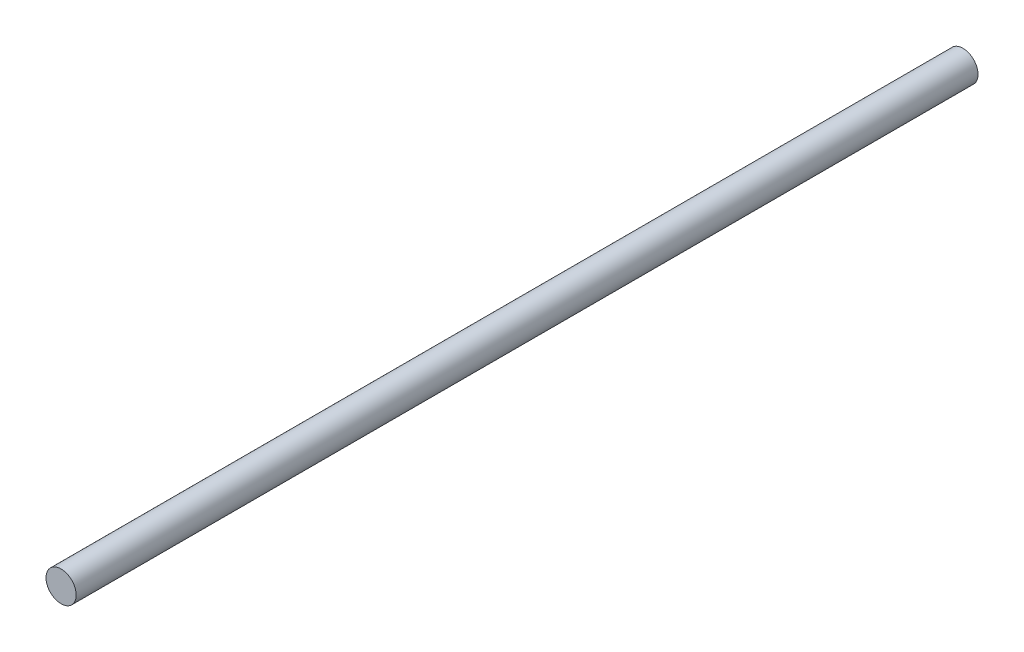
ISO-10303-21;
HEADER;
FILE_DESCRIPTION(('STEP AP214'),'2;1');
FILE_NAME('part.step','',(''),(''),'','','');
FILE_SCHEMA(('AUTOMOTIVE_DESIGN { 1 0 10303 214 1 1 1 1 }'));
ENDSEC;
DATA;
#1=APPLICATION_CONTEXT('core data for automotive mechanical design processes');
#2=APPLICATION_PROTOCOL_DEFINITION('international standard','automotive_design',2000,#1);
#3=PRODUCT_CONTEXT('',#1,'mechanical');
#4=PRODUCT('Part','Part','',(#3));
#5=PRODUCT_RELATED_PRODUCT_CATEGORY('part','',(#4));
#6=PRODUCT_DEFINITION_FORMATION('','',#4);
#7=PRODUCT_DEFINITION_CONTEXT('part definition',#1,'design');
#8=PRODUCT_DEFINITION('design','',#6,#7);
#9=PRODUCT_DEFINITION_SHAPE('','',#8);
#10=(LENGTH_UNIT() NAMED_UNIT(*) SI_UNIT(.MILLI.,.METRE.));
#11=(NAMED_UNIT(*) PLANE_ANGLE_UNIT() SI_UNIT($,.RADIAN.));
#12=(NAMED_UNIT(*) SI_UNIT($,.STERADIAN.) SOLID_ANGLE_UNIT());
#13=UNCERTAINTY_MEASURE_WITH_UNIT(LENGTH_MEASURE(1.E-05),#10,'distance_accuracy_value','');
#14=(GEOMETRIC_REPRESENTATION_CONTEXT(3) GLOBAL_UNCERTAINTY_ASSIGNED_CONTEXT((#13)) GLOBAL_UNIT_ASSIGNED_CONTEXT((#10,
#11,#12)) REPRESENTATION_CONTEXT('',''));
#15=CARTESIAN_POINT('',(0.,0.,0.));
#16=DIRECTION('',(0.,0.,1.));
#17=DIRECTION('',(1.,0.,0.));
#18=AXIS2_PLACEMENT_3D('',#15,#16,#17);
#19=CARTESIAN_POINT('',(0.,0.,76.2));
#20=DIRECTION('',(0.,0.,1.));
#21=DIRECTION('',(1.,0.,0.));
#22=AXIS2_PLACEMENT_3D('',#19,#20,#21);
#23=PLANE('',#22);
#24=CARTESIAN_POINT('',(0.,0.,76.2));
#25=DIRECTION('',(0.,0.,-1.));
#26=DIRECTION('',(-1.,0.,0.));
#27=AXIS2_PLACEMENT_3D('',#24,#25,#26);
#28=CIRCLE('',#27,2.55);
#29=CARTESIAN_POINT('',(-2.55,0.,76.2));
#30=VERTEX_POINT('',#29);
#31=EDGE_CURVE('E18',#30,#30,#28,.T.);
#32=ORIENTED_EDGE('',*,*,#31,.F.);
#33=EDGE_LOOP('',(#32));
#34=FACE_BOUND('',#33,.T.);
#35=ADVANCED_FACE('F15',(#34),#23,.T.);
#36=CARTESIAN_POINT('',(0.,0.,-76.2));
#37=DIRECTION('',(0.,0.,1.));
#38=DIRECTION('',(1.,0.,0.));
#39=AXIS2_PLACEMENT_3D('',#36,#37,#38);
#40=PLANE('',#39);
#41=CARTESIAN_POINT('',(0.,0.,-76.2));
#42=DIRECTION('',(0.,0.,-1.));
#43=DIRECTION('',(-1.,0.,0.));
#44=AXIS2_PLACEMENT_3D('',#41,#42,#43);
#45=CIRCLE('',#44,2.55);
#46=CARTESIAN_POINT('',(-2.55,0.,-76.2));
#47=VERTEX_POINT('',#46);
#48=EDGE_CURVE('E10',#47,#47,#45,.F.);
#49=ORIENTED_EDGE('',*,*,#48,.F.);
#50=EDGE_LOOP('',(#49));
#51=FACE_BOUND('',#50,.T.);
#52=ADVANCED_FACE('F30',(#51),#40,.F.);
#53=CARTESIAN_POINT('',(0.,0.,76.2));
#54=DIRECTION('',(0.,0.,-1.));
#55=DIRECTION('',(-1.,0.,0.));
#56=AXIS2_PLACEMENT_3D('',#53,#54,#55);
#57=CYLINDRICAL_SURFACE('',#56,2.55);
#58=ORIENTED_EDGE('',*,*,#48,.T.);
#59=EDGE_LOOP('',(#58));
#60=FACE_BOUND('',#59,.T.);
#61=ORIENTED_EDGE('',*,*,#31,.T.);
#62=EDGE_LOOP('',(#61));
#63=FACE_BOUND('',#62,.T.);
#64=ADVANCED_FACE('F27',(#60,#63),#57,.T.);
#65=CLOSED_SHELL('',(#35,#52,#64));
#66=MANIFOLD_SOLID_BREP('B1',#65);
#67=ADVANCED_BREP_SHAPE_REPRESENTATION('',(#18,#66),#14);
#68=SHAPE_DEFINITION_REPRESENTATION(#9,#67);
ENDSEC;
END-ISO-10303-21;
